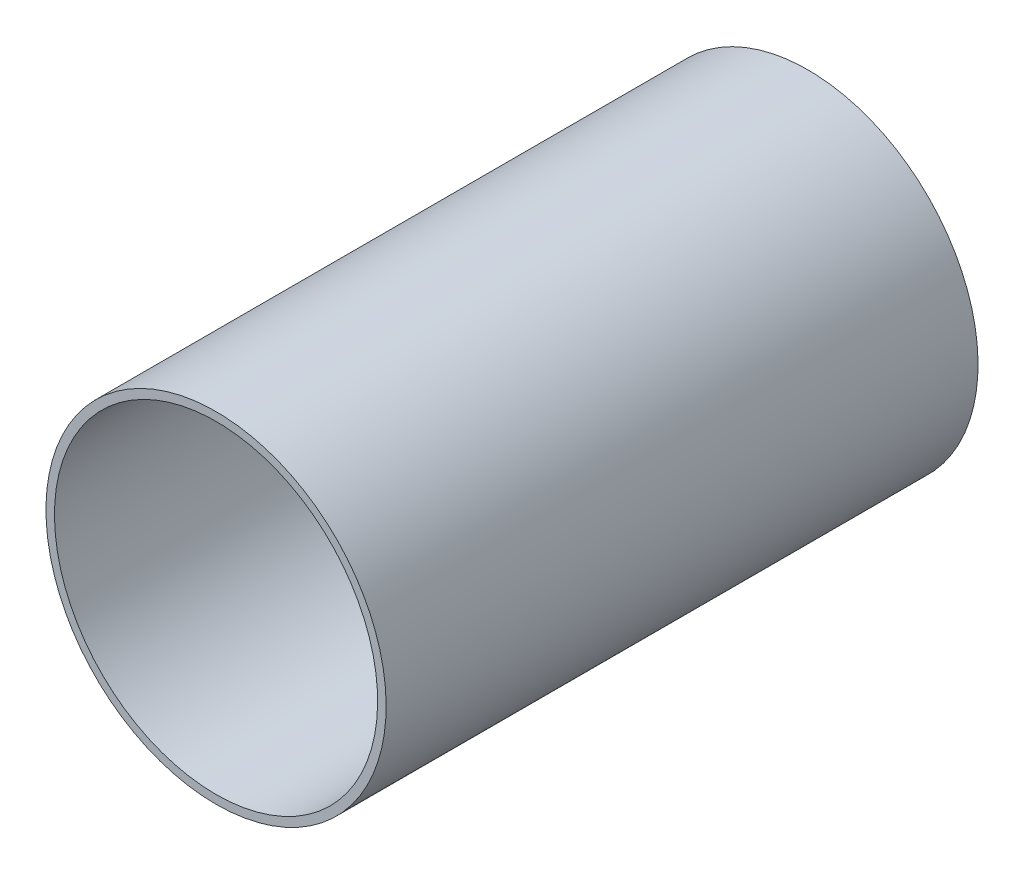
ISO-10303-21;
HEADER;
FILE_DESCRIPTION(('STEP AP214'),'2;1');
FILE_NAME('part.step','',(''),(''),'','','');
FILE_SCHEMA(('AUTOMOTIVE_DESIGN { 1 0 10303 214 1 1 1 1 }'));
ENDSEC;
DATA;
#1=APPLICATION_CONTEXT('core data for automotive mechanical design processes');
#2=APPLICATION_PROTOCOL_DEFINITION('international standard','automotive_design',2000,#1);
#3=PRODUCT_CONTEXT('',#1,'mechanical');
#4=PRODUCT('Part','Part','',(#3));
#5=PRODUCT_RELATED_PRODUCT_CATEGORY('part','',(#4));
#6=PRODUCT_DEFINITION_FORMATION('','',#4);
#7=PRODUCT_DEFINITION_CONTEXT('part definition',#1,'design');
#8=PRODUCT_DEFINITION('design','',#6,#7);
#9=PRODUCT_DEFINITION_SHAPE('','',#8);
#10=(LENGTH_UNIT() NAMED_UNIT(*) SI_UNIT(.MILLI.,.METRE.));
#11=(NAMED_UNIT(*) PLANE_ANGLE_UNIT() SI_UNIT($,.RADIAN.));
#12=(NAMED_UNIT(*) SI_UNIT($,.STERADIAN.) SOLID_ANGLE_UNIT());
#13=UNCERTAINTY_MEASURE_WITH_UNIT(LENGTH_MEASURE(1.E-05),#10,'distance_accuracy_value','');
#14=(GEOMETRIC_REPRESENTATION_CONTEXT(3) GLOBAL_UNCERTAINTY_ASSIGNED_CONTEXT((#13)) GLOBAL_UNIT_ASSIGNED_CONTEXT((#10,
#11,#12)) REPRESENTATION_CONTEXT('',''));
#15=CARTESIAN_POINT('',(0.,0.,0.));
#16=DIRECTION('',(0.,0.,1.));
#17=DIRECTION('',(1.,0.,0.));
#18=AXIS2_PLACEMENT_3D('',#15,#16,#17);
#19=CARTESIAN_POINT('',(113.792,-124.709,-0.045));
#20=DIRECTION('',(0.,0.,-1.));
#21=DIRECTION('',(0.,-1.,0.));
#22=AXIS2_PLACEMENT_3D('',#19,#20,#21);
#23=CYLINDRICAL_SURFACE('',#22,0.475);
#24=CARTESIAN_POINT('',(113.792,-124.709,-0.035));
#25=DIRECTION('',(0.,0.,-1.));
#26=DIRECTION('',(0.,-1.,0.));
#27=AXIS2_PLACEMENT_3D('',#24,#25,#26);
#28=CIRCLE('',#27,0.475);
#29=CARTESIAN_POINT('',(113.792,-125.184,-0.035));
#30=VERTEX_POINT('',#29);
#31=EDGE_CURVE('E64',#30,#30,#28,.T.);
#32=ORIENTED_EDGE('',*,*,#31,.T.);
#33=DIRECTION('',(0.,0.,1.));
#34=VECTOR('',#33,1.);
#35=CARTESIAN_POINT('',(113.792,-125.184,-0.045));
#36=LINE('',#35,#34);
#37=CARTESIAN_POINT('',(113.792,-125.184,1.705));
#38=VERTEX_POINT('',#37);
#39=EDGE_CURVE('E11',#30,#38,#36,.T.);
#40=ORIENTED_EDGE('',*,*,#39,.T.);
#41=CARTESIAN_POINT('',(113.792,-124.709,1.705));
#42=DIRECTION('',(0.,0.,-1.));
#43=DIRECTION('',(0.,-1.,0.));
#44=AXIS2_PLACEMENT_3D('',#41,#42,#43);
#45=CIRCLE('',#44,0.475);
#46=EDGE_CURVE('E25',#38,#38,#45,.T.);
#47=ORIENTED_EDGE('',*,*,#46,.F.);
#48=ORIENTED_EDGE('',*,*,#39,.F.);
#49=EDGE_LOOP('',(#32,#40,#47,#48));
#50=FACE_BOUND('',#49,.T.);
#51=ADVANCED_FACE('F17',(#50),#23,.F.);
#52=CARTESIAN_POINT('',(113.792,-125.209,1.705));
#53=DIRECTION('',(0.,0.,1.));
#54=DIRECTION('',(1.,0.,0.));
#55=AXIS2_PLACEMENT_3D('',#52,#53,#54);
#56=PLANE('',#55);
#57=ORIENTED_EDGE('',*,*,#46,.T.);
#58=EDGE_LOOP('',(#57));
#59=FACE_BOUND('',#58,.T.);
#60=CARTESIAN_POINT('',(113.792,-124.709,1.705));
#61=DIRECTION('',(0.,0.,1.));
#62=DIRECTION('',(0.,-1.,0.));
#63=AXIS2_PLACEMENT_3D('',#60,#61,#62);
#64=CIRCLE('',#63,0.5);
#65=CARTESIAN_POINT('',(113.792,-125.209,1.705));
#66=VERTEX_POINT('',#65);
#67=EDGE_CURVE('E56',#66,#66,#64,.T.);
#68=ORIENTED_EDGE('',*,*,#67,.T.);
#69=EDGE_LOOP('',(#68));
#70=FACE_BOUND('',#69,.T.);
#71=ADVANCED_FACE('F73',(#59,#70),#56,.T.);
#72=CARTESIAN_POINT('',(113.792,-125.209,-0.035));
#73=DIRECTION('',(0.,0.,1.));
#74=DIRECTION('',(1.,0.,0.));
#75=AXIS2_PLACEMENT_3D('',#72,#73,#74);
#76=PLANE('',#75);
#77=ORIENTED_EDGE('',*,*,#31,.F.);
#78=EDGE_LOOP('',(#77));
#79=FACE_BOUND('',#78,.T.);
#80=CARTESIAN_POINT('',(113.792,-124.709,-0.035));
#81=DIRECTION('',(0.,0.,1.));
#82=DIRECTION('',(0.,-1.,0.));
#83=AXIS2_PLACEMENT_3D('',#80,#81,#82);
#84=CIRCLE('',#83,0.5);
#85=CARTESIAN_POINT('',(113.792,-125.209,-0.035));
#86=VERTEX_POINT('',#85);
#87=EDGE_CURVE('E55',#86,#86,#84,.T.);
#88=ORIENTED_EDGE('',*,*,#87,.F.);
#89=EDGE_LOOP('',(#88));
#90=FACE_BOUND('',#89,.T.);
#91=ADVANCED_FACE('F82',(#79,#90),#76,.F.);
#92=CARTESIAN_POINT('',(113.792,-124.709,-0.035));
#93=DIRECTION('',(0.,0.,-1.));
#94=DIRECTION('',(0.,-1.,0.));
#95=AXIS2_PLACEMENT_3D('',#92,#93,#94);
#96=CYLINDRICAL_SURFACE('',#95,0.5);
#97=ORIENTED_EDGE('',*,*,#87,.T.);
#98=DIRECTION('',(0.,0.,1.));
#99=VECTOR('',#98,1.);
#100=CARTESIAN_POINT('',(113.792,-125.209,-0.035));
#101=LINE('',#100,#99);
#102=EDGE_CURVE('E52',#86,#66,#101,.T.);
#103=ORIENTED_EDGE('',*,*,#102,.T.);
#104=ORIENTED_EDGE('',*,*,#67,.F.);
#105=ORIENTED_EDGE('',*,*,#102,.F.);
#106=EDGE_LOOP('',(#97,#103,#104,#105));
#107=FACE_BOUND('',#106,.T.);
#108=ADVANCED_FACE('F53',(#107),#96,.T.);
#109=CLOSED_SHELL('',(#51,#71,#91,#108));
#110=MANIFOLD_SOLID_BREP('B1',#109);
#111=ADVANCED_BREP_SHAPE_REPRESENTATION('',(#18,#110),#14);
#112=SHAPE_DEFINITION_REPRESENTATION(#9,#111);
ENDSEC;
END-ISO-10303-21;
